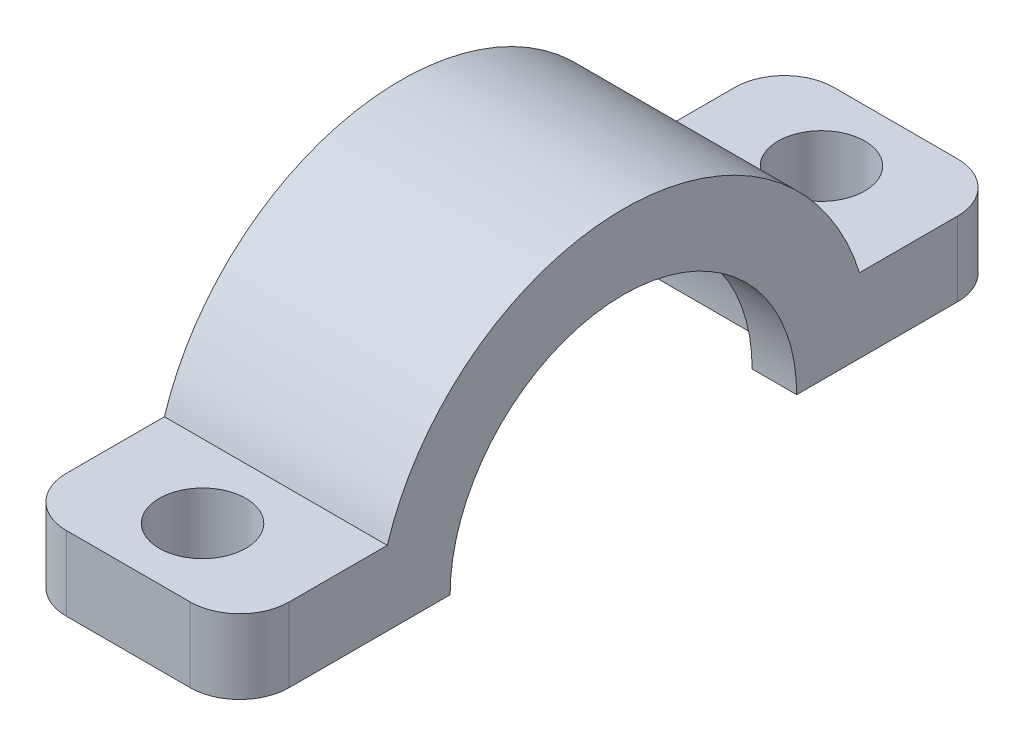
ISO-10303-21;
HEADER;
FILE_DESCRIPTION(('STEP AP214'),'2;1');
FILE_NAME('part.step','',(''),(''),'','','');
FILE_SCHEMA(('AUTOMOTIVE_DESIGN { 1 0 10303 214 1 1 1 1 }'));
ENDSEC;
DATA;
#1=APPLICATION_CONTEXT('core data for automotive mechanical design processes');
#2=APPLICATION_PROTOCOL_DEFINITION('international standard','automotive_design',2000,#1);
#3=PRODUCT_CONTEXT('',#1,'mechanical');
#4=PRODUCT('Part','Part','',(#3));
#5=PRODUCT_RELATED_PRODUCT_CATEGORY('part','',(#4));
#6=PRODUCT_DEFINITION_FORMATION('','',#4);
#7=PRODUCT_DEFINITION_CONTEXT('part definition',#1,'design');
#8=PRODUCT_DEFINITION('design','',#6,#7);
#9=PRODUCT_DEFINITION_SHAPE('','',#8);
#10=(LENGTH_UNIT() NAMED_UNIT(*) SI_UNIT(.MILLI.,.METRE.));
#11=(NAMED_UNIT(*) PLANE_ANGLE_UNIT() SI_UNIT($,.RADIAN.));
#12=(NAMED_UNIT(*) SI_UNIT($,.STERADIAN.) SOLID_ANGLE_UNIT());
#13=UNCERTAINTY_MEASURE_WITH_UNIT(LENGTH_MEASURE(1.E-05),#10,'distance_accuracy_value','');
#14=(GEOMETRIC_REPRESENTATION_CONTEXT(3) GLOBAL_UNCERTAINTY_ASSIGNED_CONTEXT((#13)) GLOBAL_UNIT_ASSIGNED_CONTEXT((#10,
#11,#12)) REPRESENTATION_CONTEXT('',''));
#15=CARTESIAN_POINT('',(0.,0.,0.));
#16=DIRECTION('',(0.,0.,1.));
#17=DIRECTION('',(1.,0.,0.));
#18=AXIS2_PLACEMENT_3D('',#15,#16,#17);
#19=CARTESIAN_POINT('',(-4.5,-1.5,0.));
#20=DIRECTION('',(1.,0.,0.));
#21=DIRECTION('',(0.,0.,-1.));
#22=AXIS2_PLACEMENT_3D('',#19,#20,#21);
#23=CYLINDRICAL_SURFACE('',#22,7.);
#24=DIRECTION('',(1.,0.,0.));
#25=VECTOR('',#24,1.);
#26=CARTESIAN_POINT('',(-4.5,-1.5,-7.));
#27=LINE('',#26,#25);
#28=CARTESIAN_POINT('',(-4.5,-1.5,-7.));
#29=VERTEX_POINT('',#28);
#30=CARTESIAN_POINT('',(-2.7,-1.5,-7.));
#31=VERTEX_POINT('',#30);
#32=EDGE_CURVE('E249',#29,#31,#27,.T.);
#33=ORIENTED_EDGE('',*,*,#32,.T.);
#34=CARTESIAN_POINT('',(-2.7,-1.5,0.));
#35=DIRECTION('',(1.,0.,0.));
#36=DIRECTION('',(0.,0.,-1.));
#37=AXIS2_PLACEMENT_3D('',#34,#35,#36);
#38=CIRCLE('',#37,7.);
#39=CARTESIAN_POINT('',(-2.7,-1.5,7.));
#40=VERTEX_POINT('',#39);
#41=EDGE_CURVE('E159',#31,#40,#38,.T.);
#42=ORIENTED_EDGE('',*,*,#41,.T.);
#43=DIRECTION('',(1.,0.,0.));
#44=VECTOR('',#43,1.);
#45=CARTESIAN_POINT('',(-4.5,-1.5,7.));
#46=LINE('',#45,#44);
#47=CARTESIAN_POINT('',(-4.5,-1.5,7.));
#48=VERTEX_POINT('',#47);
#49=EDGE_CURVE('E254',#48,#40,#46,.T.);
#50=ORIENTED_EDGE('',*,*,#49,.F.);
#51=CARTESIAN_POINT('',(-4.5,-1.5,0.));
#52=DIRECTION('',(-1.,0.,0.));
#53=DIRECTION('',(0.,0.,-1.));
#54=AXIS2_PLACEMENT_3D('',#51,#52,#53);
#55=CIRCLE('',#54,7.);
#56=EDGE_CURVE('E244',#48,#29,#55,.T.);
#57=ORIENTED_EDGE('',*,*,#56,.T.);
#58=EDGE_LOOP('',(#33,#42,#50,#57));
#59=FACE_BOUND('',#58,.T.);
#60=ADVANCED_FACE('F43',(#59),#23,.F.);
#61=CARTESIAN_POINT('',(-4.5,-1.5,-7.));
#62=DIRECTION('',(0.,-1.,0.));
#63=DIRECTION('',(0.,0.,-1.));
#64=AXIS2_PLACEMENT_3D('',#61,#62,#63);
#65=PLANE('',#64);
#66=DIRECTION('',(0.,0.,1.));
#67=VECTOR('',#66,1.);
#68=CARTESIAN_POINT('',(2.7,-1.5,-7.));
#69=LINE('',#68,#67);
#70=CARTESIAN_POINT('',(2.7,-1.5,-8.25));
#71=VERTEX_POINT('',#70);
#72=CARTESIAN_POINT('',(2.7,-1.5,-7.));
#73=VERTEX_POINT('',#72);
#74=EDGE_CURVE('E180',#71,#73,#69,.T.);
#75=ORIENTED_EDGE('',*,*,#74,.F.);
#76=DIRECTION('',(-1.,0.,0.));
#77=VECTOR('',#76,1.);
#78=CARTESIAN_POINT('',(2.7,-1.5,-8.25));
#79=LINE('',#78,#77);
#80=CARTESIAN_POINT('',(-2.7,-1.5,-8.25));
#81=VERTEX_POINT('',#80);
#82=EDGE_CURVE('E169',#71,#81,#79,.T.);
#83=ORIENTED_EDGE('',*,*,#82,.T.);
#84=DIRECTION('',(0.,0.,1.));
#85=VECTOR('',#84,1.);
#86=CARTESIAN_POINT('',(-2.7,-1.5,-7.));
#87=LINE('',#86,#85);
#88=EDGE_CURVE('E156',#81,#31,#87,.T.);
#89=ORIENTED_EDGE('',*,*,#88,.T.);
#90=ORIENTED_EDGE('',*,*,#32,.F.);
#91=DIRECTION('',(0.,0.,-1.));
#92=VECTOR('',#91,1.);
#93=CARTESIAN_POINT('',(-4.5,-1.5,-7.));
#94=LINE('',#93,#92);
#95=CARTESIAN_POINT('',(-4.5,-1.5,-13.5));
#96=VERTEX_POINT('',#95);
#97=EDGE_CURVE('E226',#29,#96,#94,.T.);
#98=ORIENTED_EDGE('',*,*,#97,.T.);
#99=CARTESIAN_POINT('',(-2.5,-1.5,-13.5));
#100=DIRECTION('',(0.,-1.,0.));
#101=DIRECTION('',(0.,0.,-1.));
#102=AXIS2_PLACEMENT_3D('',#99,#100,#101);
#103=CIRCLE('',#102,2.);
#104=CARTESIAN_POINT('',(-2.5,-1.5,-15.5));
#105=VERTEX_POINT('',#104);
#106=EDGE_CURVE('E323',#96,#105,#103,.T.);
#107=ORIENTED_EDGE('',*,*,#106,.T.);
#108=DIRECTION('',(1.,0.,0.));
#109=VECTOR('',#108,1.);
#110=CARTESIAN_POINT('',(-4.5,-1.5,-15.5));
#111=LINE('',#110,#109);
#112=CARTESIAN_POINT('',(2.5,-1.5,-15.5));
#113=VERTEX_POINT('',#112);
#114=EDGE_CURVE('E248',#105,#113,#111,.T.);
#115=ORIENTED_EDGE('',*,*,#114,.T.);
#116=CARTESIAN_POINT('',(2.5,-1.5,-13.5));
#117=DIRECTION('',(0.,-1.,0.));
#118=DIRECTION('',(0.,0.,-1.));
#119=AXIS2_PLACEMENT_3D('',#116,#117,#118);
#120=CIRCLE('',#119,2.);
#121=CARTESIAN_POINT('',(4.5,-1.5,-13.5));
#122=VERTEX_POINT('',#121);
#123=EDGE_CURVE('E326',#113,#122,#120,.T.);
#124=ORIENTED_EDGE('',*,*,#123,.T.);
#125=DIRECTION('',(0.,0.,-1.));
#126=VECTOR('',#125,1.);
#127=CARTESIAN_POINT('',(4.5,-1.5,-7.));
#128=LINE('',#127,#126);
#129=CARTESIAN_POINT('',(4.5,-1.5,-7.));
#130=VERTEX_POINT('',#129);
#131=EDGE_CURVE('E196',#130,#122,#128,.T.);
#132=ORIENTED_EDGE('',*,*,#131,.F.);
#133=EDGE_CURVE('E253',#73,#130,#27,.T.);
#134=ORIENTED_EDGE('',*,*,#133,.F.);
#135=EDGE_LOOP('',(#75,#83,#89,#90,#98,#107,#115,#124,#132,#134));
#136=FACE_BOUND('',#135,.T.);
#137=CARTESIAN_POINT('',(0.,-1.5,-12.5));
#138=DIRECTION('',(0.,1.,0.));
#139=DIRECTION('',(0.,0.,1.));
#140=AXIS2_PLACEMENT_3D('',#137,#138,#139);
#141=CIRCLE('',#140,1.75);
#142=CARTESIAN_POINT('',(0.,-1.5,-10.75));
#143=VERTEX_POINT('',#142);
#144=EDGE_CURVE('E192',#143,#143,#141,.T.);
#145=ORIENTED_EDGE('',*,*,#144,.T.);
#146=EDGE_LOOP('',(#145));
#147=FACE_BOUND('',#146,.T.);
#148=ADVANCED_FACE('F177',(#136,#147),#65,.T.);
#149=CARTESIAN_POINT('',(2.7,-1.5,0.));
#150=DIRECTION('',(1.,0.,0.));
#151=DIRECTION('',(0.,0.,-1.));
#152=AXIS2_PLACEMENT_3D('',#149,#150,#151);
#153=CIRCLE('',#152,7.);
#154=CARTESIAN_POINT('',(2.7,-1.5,7.));
#155=VERTEX_POINT('',#154);
#156=EDGE_CURVE('E164',#73,#155,#153,.T.);
#157=ORIENTED_EDGE('',*,*,#156,.F.);
#158=ORIENTED_EDGE('',*,*,#133,.T.);
#159=CARTESIAN_POINT('',(4.5,-1.5,0.));
#160=DIRECTION('',(-1.,0.,0.));
#161=DIRECTION('',(0.,0.,-1.));
#162=AXIS2_PLACEMENT_3D('',#159,#160,#161);
#163=CIRCLE('',#162,7.);
#164=CARTESIAN_POINT('',(4.5,-1.5,7.));
#165=VERTEX_POINT('',#164);
#166=EDGE_CURVE('E222',#165,#130,#163,.T.);
#167=ORIENTED_EDGE('',*,*,#166,.F.);
#168=EDGE_CURVE('E258',#155,#165,#46,.T.);
#169=ORIENTED_EDGE('',*,*,#168,.F.);
#170=EDGE_LOOP('',(#157,#158,#167,#169));
#171=FACE_BOUND('',#170,.T.);
#172=ADVANCED_FACE('F349',(#171),#23,.F.);
#173=CARTESIAN_POINT('',(-4.5,-1.5,15.5));
#174=DIRECTION('',(0.,-1.,0.));
#175=DIRECTION('',(0.,0.,-1.));
#176=AXIS2_PLACEMENT_3D('',#173,#174,#175);
#177=PLANE('',#176);
#178=DIRECTION('',(0.,0.,1.));
#179=VECTOR('',#178,1.);
#180=CARTESIAN_POINT('',(2.7,-1.5,15.5));
#181=LINE('',#180,#179);
#182=CARTESIAN_POINT('',(2.7,-1.5,8.25));
#183=VERTEX_POINT('',#182);
#184=EDGE_CURVE('E11',#155,#183,#181,.T.);
#185=ORIENTED_EDGE('',*,*,#184,.F.);
#186=ORIENTED_EDGE('',*,*,#168,.T.);
#187=DIRECTION('',(0.,0.,-1.));
#188=VECTOR('',#187,1.);
#189=CARTESIAN_POINT('',(4.5,-1.5,15.5));
#190=LINE('',#189,#188);
#191=CARTESIAN_POINT('',(4.5,-1.5,13.5));
#192=VERTEX_POINT('',#191);
#193=EDGE_CURVE('E218',#192,#165,#190,.T.);
#194=ORIENTED_EDGE('',*,*,#193,.F.);
#195=CARTESIAN_POINT('',(2.5,-1.5,13.5));
#196=DIRECTION('',(0.,-1.,0.));
#197=DIRECTION('',(0.,0.,-1.));
#198=AXIS2_PLACEMENT_3D('',#195,#196,#197);
#199=CIRCLE('',#198,2.);
#200=CARTESIAN_POINT('',(2.5,-1.5,15.5));
#201=VERTEX_POINT('',#200);
#202=EDGE_CURVE('E289',#192,#201,#199,.T.);
#203=ORIENTED_EDGE('',*,*,#202,.T.);
#204=DIRECTION('',(1.,0.,0.));
#205=VECTOR('',#204,1.);
#206=CARTESIAN_POINT('',(-4.5,-1.5,15.5));
#207=LINE('',#206,#205);
#208=CARTESIAN_POINT('',(-2.5,-1.5,15.5));
#209=VERTEX_POINT('',#208);
#210=EDGE_CURVE('E259',#209,#201,#207,.T.);
#211=ORIENTED_EDGE('',*,*,#210,.F.);
#212=CARTESIAN_POINT('',(-2.5,-1.5,13.5));
#213=DIRECTION('',(0.,-1.,0.));
#214=DIRECTION('',(0.,0.,-1.));
#215=AXIS2_PLACEMENT_3D('',#212,#213,#214);
#216=CIRCLE('',#215,2.);
#217=CARTESIAN_POINT('',(-4.5,-1.5,13.5));
#218=VERTEX_POINT('',#217);
#219=EDGE_CURVE('E286',#209,#218,#216,.T.);
#220=ORIENTED_EDGE('',*,*,#219,.T.);
#221=DIRECTION('',(0.,0.,-1.));
#222=VECTOR('',#221,1.);
#223=CARTESIAN_POINT('',(-4.5,-1.5,15.5));
#224=LINE('',#223,#222);
#225=EDGE_CURVE('E241',#218,#48,#224,.T.);
#226=ORIENTED_EDGE('',*,*,#225,.T.);
#227=ORIENTED_EDGE('',*,*,#49,.T.);
#228=DIRECTION('',(0.,0.,1.));
#229=VECTOR('',#228,1.);
#230=CARTESIAN_POINT('',(-2.7,-1.5,15.5));
#231=LINE('',#230,#229);
#232=CARTESIAN_POINT('',(-2.7,-1.5,8.25));
#233=VERTEX_POINT('',#232);
#234=EDGE_CURVE('E329',#40,#233,#231,.T.);
#235=ORIENTED_EDGE('',*,*,#234,.T.);
#236=DIRECTION('',(-1.,0.,0.));
#237=VECTOR('',#236,1.);
#238=CARTESIAN_POINT('',(2.7,-1.5,8.25));
#239=LINE('',#238,#237);
#240=EDGE_CURVE('E52',#233,#183,#239,.F.);
#241=ORIENTED_EDGE('',*,*,#240,.T.);
#242=EDGE_LOOP('',(#185,#186,#194,#203,#211,#220,#226,#227,#235,#241));
#243=FACE_BOUND('',#242,.T.);
#244=CARTESIAN_POINT('',(0.,-1.5,12.5));
#245=DIRECTION('',(0.,1.,0.));
#246=DIRECTION('',(0.,0.,1.));
#247=AXIS2_PLACEMENT_3D('',#244,#245,#246);
#248=CIRCLE('',#247,1.75);
#249=CARTESIAN_POINT('',(0.,-1.5,14.25));
#250=VERTEX_POINT('',#249);
#251=EDGE_CURVE('E182',#250,#250,#248,.T.);
#252=ORIENTED_EDGE('',*,*,#251,.T.);
#253=EDGE_LOOP('',(#252));
#254=FACE_BOUND('',#253,.T.);
#255=ADVANCED_FACE('F334',(#243,#254),#177,.T.);
#256=CARTESIAN_POINT('',(-4.5,1.5,15.5));
#257=DIRECTION('',(0.,0.,1.));
#258=DIRECTION('',(1.,0.,0.));
#259=AXIS2_PLACEMENT_3D('',#256,#257,#258);
#260=PLANE('',#259);
#261=ORIENTED_EDGE('',*,*,#210,.T.);
#262=DIRECTION('',(0.,-1.,0.));
#263=VECTOR('',#262,1.);
#264=CARTESIAN_POINT('',(2.5,1.5,15.5));
#265=LINE('',#264,#263);
#266=CARTESIAN_POINT('',(2.5,1.5,15.5));
#267=VERTEX_POINT('',#266);
#268=EDGE_CURVE('E296',#201,#267,#265,.F.);
#269=ORIENTED_EDGE('',*,*,#268,.T.);
#270=DIRECTION('',(1.,0.,0.));
#271=VECTOR('',#270,1.);
#272=CARTESIAN_POINT('',(-4.5,1.5,15.5));
#273=LINE('',#272,#271);
#274=CARTESIAN_POINT('',(-2.5,1.5,15.5));
#275=VERTEX_POINT('',#274);
#276=EDGE_CURVE('E263',#275,#267,#273,.T.);
#277=ORIENTED_EDGE('',*,*,#276,.F.);
#278=DIRECTION('',(0.,-1.,0.));
#279=VECTOR('',#278,1.);
#280=CARTESIAN_POINT('',(-2.5,-1.5,15.5));
#281=LINE('',#280,#279);
#282=EDGE_CURVE('E292',#275,#209,#281,.T.);
#283=ORIENTED_EDGE('',*,*,#282,.T.);
#284=EDGE_LOOP('',(#261,#269,#277,#283));
#285=FACE_BOUND('',#284,.T.);
#286=ADVANCED_FACE('F365',(#285),#260,.T.);
#287=CARTESIAN_POINT('',(-4.5,1.5,15.5));
#288=DIRECTION('',(0.,1.,0.));
#289=DIRECTION('',(0.,0.,1.));
#290=AXIS2_PLACEMENT_3D('',#287,#288,#289);
#291=PLANE('',#290);
#292=CARTESIAN_POINT('',(0.,1.5,12.5));
#293=DIRECTION('',(0.,1.,0.));
#294=DIRECTION('',(0.,0.,1.));
#295=AXIS2_PLACEMENT_3D('',#292,#293,#294);
#296=CIRCLE('',#295,1.75);
#297=CARTESIAN_POINT('',(0.,1.5,14.25));
#298=VERTEX_POINT('',#297);
#299=EDGE_CURVE('E187',#298,#298,#296,.T.);
#300=ORIENTED_EDGE('',*,*,#299,.F.);
#301=EDGE_LOOP('',(#300));
#302=FACE_BOUND('',#301,.T.);
#303=ORIENTED_EDGE('',*,*,#276,.T.);
#304=CARTESIAN_POINT('',(2.5,1.5,13.5));
#305=DIRECTION('',(0.,1.,0.));
#306=DIRECTION('',(0.,0.,1.));
#307=AXIS2_PLACEMENT_3D('',#304,#305,#306);
#308=CIRCLE('',#307,2.);
#309=CARTESIAN_POINT('',(4.5,1.5,13.5));
#310=VERTEX_POINT('',#309);
#311=EDGE_CURVE('E302',#267,#310,#308,.T.);
#312=ORIENTED_EDGE('',*,*,#311,.T.);
#313=DIRECTION('',(0.,0.,1.));
#314=VECTOR('',#313,1.);
#315=CARTESIAN_POINT('',(4.5,1.5,15.5));
#316=LINE('',#315,#314);
#317=CARTESIAN_POINT('',(4.5,1.5,9.53939201416946));
#318=VERTEX_POINT('',#317);
#319=EDGE_CURVE('E214',#318,#310,#316,.T.);
#320=ORIENTED_EDGE('',*,*,#319,.F.);
#321=DIRECTION('',(1.,0.,0.));
#322=VECTOR('',#321,1.);
#323=CARTESIAN_POINT('',(-4.5,1.5,9.53939201416946));
#324=LINE('',#323,#322);
#325=CARTESIAN_POINT('',(-4.5,1.5,9.53939201416946));
#326=VERTEX_POINT('',#325);
#327=EDGE_CURVE('E267',#326,#318,#324,.T.);
#328=ORIENTED_EDGE('',*,*,#327,.F.);
#329=DIRECTION('',(0.,0.,1.));
#330=VECTOR('',#329,1.);
#331=CARTESIAN_POINT('',(-4.5,1.5,15.5));
#332=LINE('',#331,#330);
#333=CARTESIAN_POINT('',(-4.5,1.5,13.5));
#334=VERTEX_POINT('',#333);
#335=EDGE_CURVE('E237',#326,#334,#332,.T.);
#336=ORIENTED_EDGE('',*,*,#335,.T.);
#337=CARTESIAN_POINT('',(-2.5,1.5,13.5));
#338=DIRECTION('',(0.,1.,0.));
#339=DIRECTION('',(0.,0.,1.));
#340=AXIS2_PLACEMENT_3D('',#337,#338,#339);
#341=CIRCLE('',#340,2.);
#342=EDGE_CURVE('E299',#334,#275,#341,.T.);
#343=ORIENTED_EDGE('',*,*,#342,.T.);
#344=EDGE_LOOP('',(#303,#312,#320,#328,#336,#343));
#345=FACE_BOUND('',#344,.T.);
#346=ADVANCED_FACE('F397',(#302,#345),#291,.T.);
#347=CARTESIAN_POINT('',(-4.5,-1.5,0.));
#348=DIRECTION('',(1.,0.,0.));
#349=DIRECTION('',(0.,0.,-1.));
#350=AXIS2_PLACEMENT_3D('',#347,#348,#349);
#351=CYLINDRICAL_SURFACE('',#350,10.);
#352=ORIENTED_EDGE('',*,*,#327,.T.);
#353=CARTESIAN_POINT('',(4.5,-1.5,0.));
#354=DIRECTION('',(1.,0.,0.));
#355=DIRECTION('',(0.,0.,-1.));
#356=AXIS2_PLACEMENT_3D('',#353,#354,#355);
#357=CIRCLE('',#356,10.);
#358=CARTESIAN_POINT('',(4.5,1.5,-9.53939201416946));
#359=VERTEX_POINT('',#358);
#360=EDGE_CURVE('E210',#359,#318,#357,.T.);
#361=ORIENTED_EDGE('',*,*,#360,.F.);
#362=DIRECTION('',(1.,0.,0.));
#363=VECTOR('',#362,1.);
#364=CARTESIAN_POINT('',(-4.5,1.5,-9.53939201416946));
#365=LINE('',#364,#363);
#366=CARTESIAN_POINT('',(-4.5,1.5,-9.53939201416946));
#367=VERTEX_POINT('',#366);
#368=EDGE_CURVE('E270',#367,#359,#365,.T.);
#369=ORIENTED_EDGE('',*,*,#368,.F.);
#370=CARTESIAN_POINT('',(-4.5,-1.5,0.));
#371=DIRECTION('',(1.,0.,0.));
#372=DIRECTION('',(0.,0.,-1.));
#373=AXIS2_PLACEMENT_3D('',#370,#371,#372);
#374=CIRCLE('',#373,10.);
#375=EDGE_CURVE('E233',#367,#326,#374,.T.);
#376=ORIENTED_EDGE('',*,*,#375,.T.);
#377=EDGE_LOOP('',(#352,#361,#369,#376));
#378=FACE_BOUND('',#377,.T.);
#379=ADVANCED_FACE('F395',(#378),#351,.T.);
#380=CARTESIAN_POINT('',(-4.5,1.5,-9.53939201416946));
#381=DIRECTION('',(0.,1.,0.));
#382=DIRECTION('',(0.,0.,1.));
#383=AXIS2_PLACEMENT_3D('',#380,#381,#382);
#384=PLANE('',#383);
#385=CARTESIAN_POINT('',(0.,1.5,-12.5));
#386=DIRECTION('',(0.,1.,0.));
#387=DIRECTION('',(0.,0.,1.));
#388=AXIS2_PLACEMENT_3D('',#385,#386,#387);
#389=CIRCLE('',#388,1.75);
#390=CARTESIAN_POINT('',(0.,1.5,-10.75));
#391=VERTEX_POINT('',#390);
#392=EDGE_CURVE('E197',#391,#391,#389,.T.);
#393=ORIENTED_EDGE('',*,*,#392,.F.);
#394=EDGE_LOOP('',(#393));
#395=FACE_BOUND('',#394,.T.);
#396=DIRECTION('',(0.,0.,1.));
#397=VECTOR('',#396,1.);
#398=CARTESIAN_POINT('',(4.5,1.5,-9.53939201416946));
#399=LINE('',#398,#397);
#400=CARTESIAN_POINT('',(4.5,1.5,-13.5));
#401=VERTEX_POINT('',#400);
#402=EDGE_CURVE('E207',#401,#359,#399,.T.);
#403=ORIENTED_EDGE('',*,*,#402,.F.);
#404=CARTESIAN_POINT('',(2.5,1.5,-13.5));
#405=DIRECTION('',(0.,1.,0.));
#406=DIRECTION('',(0.,0.,1.));
#407=AXIS2_PLACEMENT_3D('',#404,#405,#406);
#408=CIRCLE('',#407,2.);
#409=CARTESIAN_POINT('',(2.5,1.5,-15.5));
#410=VERTEX_POINT('',#409);
#411=EDGE_CURVE('E314',#401,#410,#408,.T.);
#412=ORIENTED_EDGE('',*,*,#411,.T.);
#413=DIRECTION('',(1.,0.,0.));
#414=VECTOR('',#413,1.);
#415=CARTESIAN_POINT('',(-4.5,1.5,-15.5));
#416=LINE('',#415,#414);
#417=CARTESIAN_POINT('',(-2.5,1.5,-15.5));
#418=VERTEX_POINT('',#417);
#419=EDGE_CURVE('E274',#418,#410,#416,.T.);
#420=ORIENTED_EDGE('',*,*,#419,.F.);
#421=CARTESIAN_POINT('',(-2.5,1.5,-13.5));
#422=DIRECTION('',(0.,1.,0.));
#423=DIRECTION('',(0.,0.,1.));
#424=AXIS2_PLACEMENT_3D('',#421,#422,#423);
#425=CIRCLE('',#424,2.);
#426=CARTESIAN_POINT('',(-4.5,1.5,-13.5));
#427=VERTEX_POINT('',#426);
#428=EDGE_CURVE('E311',#418,#427,#425,.T.);
#429=ORIENTED_EDGE('',*,*,#428,.T.);
#430=DIRECTION('',(0.,0.,1.));
#431=VECTOR('',#430,1.);
#432=CARTESIAN_POINT('',(-4.5,1.5,-9.53939201416946));
#433=LINE('',#432,#431);
#434=EDGE_CURVE('E230',#427,#367,#433,.T.);
#435=ORIENTED_EDGE('',*,*,#434,.T.);
#436=ORIENTED_EDGE('',*,*,#368,.T.);
#437=EDGE_LOOP('',(#403,#412,#420,#429,#435,#436));
#438=FACE_BOUND('',#437,.T.);
#439=ADVANCED_FACE('F386',(#395,#438),#384,.T.);
#440=CARTESIAN_POINT('',(-4.5,1.5,-15.5));
#441=DIRECTION('',(0.,0.,-1.));
#442=DIRECTION('',(-1.,0.,0.));
#443=AXIS2_PLACEMENT_3D('',#440,#441,#442);
#444=PLANE('',#443);
#445=ORIENTED_EDGE('',*,*,#419,.T.);
#446=DIRECTION('',(0.,1.,0.));
#447=VECTOR('',#446,1.);
#448=CARTESIAN_POINT('',(2.5,1.5,-15.5));
#449=LINE('',#448,#447);
#450=EDGE_CURVE('E67',#410,#113,#449,.F.);
#451=ORIENTED_EDGE('',*,*,#450,.T.);
#452=ORIENTED_EDGE('',*,*,#114,.F.);
#453=DIRECTION('',(0.,1.,0.));
#454=VECTOR('',#453,1.);
#455=CARTESIAN_POINT('',(-2.5,1.5,-15.5));
#456=LINE('',#455,#454);
#457=EDGE_CURVE('E317',#105,#418,#456,.T.);
#458=ORIENTED_EDGE('',*,*,#457,.T.);
#459=EDGE_LOOP('',(#445,#451,#452,#458));
#460=FACE_BOUND('',#459,.T.);
#461=ADVANCED_FACE('F383',(#460),#444,.T.);
#462=CARTESIAN_POINT('',(-4.5,-1.5,0.));
#463=DIRECTION('',(1.,0.,0.));
#464=DIRECTION('',(0.,0.,-1.));
#465=AXIS2_PLACEMENT_3D('',#462,#463,#464);
#466=PLANE('',#465);
#467=ORIENTED_EDGE('',*,*,#225,.F.);
#468=DIRECTION('',(0.,-1.,0.));
#469=VECTOR('',#468,1.);
#470=CARTESIAN_POINT('',(-4.5,1.5,13.5));
#471=LINE('',#470,#469);
#472=EDGE_CURVE('E308',#218,#334,#471,.F.);
#473=ORIENTED_EDGE('',*,*,#472,.T.);
#474=ORIENTED_EDGE('',*,*,#335,.F.);
#475=ORIENTED_EDGE('',*,*,#375,.F.);
#476=ORIENTED_EDGE('',*,*,#434,.F.);
#477=DIRECTION('',(0.,1.,0.));
#478=VECTOR('',#477,1.);
#479=CARTESIAN_POINT('',(-4.5,-1.5,-13.5));
#480=LINE('',#479,#478);
#481=EDGE_CURVE('E305',#427,#96,#480,.F.);
#482=ORIENTED_EDGE('',*,*,#481,.T.);
#483=ORIENTED_EDGE('',*,*,#97,.F.);
#484=ORIENTED_EDGE('',*,*,#56,.F.);
#485=EDGE_LOOP('',(#467,#473,#474,#475,#476,#482,#483,#484));
#486=FACE_BOUND('',#485,.T.);
#487=ADVANCED_FACE('F374',(#486),#466,.F.);
#488=CARTESIAN_POINT('',(4.5,-1.5,0.));
#489=DIRECTION('',(1.,0.,0.));
#490=DIRECTION('',(0.,0.,-1.));
#491=AXIS2_PLACEMENT_3D('',#488,#489,#490);
#492=PLANE('',#491);
#493=ORIENTED_EDGE('',*,*,#319,.T.);
#494=DIRECTION('',(0.,-1.,0.));
#495=VECTOR('',#494,1.);
#496=CARTESIAN_POINT('',(4.5,-1.5,13.5));
#497=LINE('',#496,#495);
#498=EDGE_CURVE('E282',#310,#192,#497,.T.);
#499=ORIENTED_EDGE('',*,*,#498,.T.);
#500=ORIENTED_EDGE('',*,*,#193,.T.);
#501=ORIENTED_EDGE('',*,*,#166,.T.);
#502=ORIENTED_EDGE('',*,*,#131,.T.);
#503=DIRECTION('',(0.,1.,0.));
#504=VECTOR('',#503,1.);
#505=CARTESIAN_POINT('',(4.5,-1.5,-13.5));
#506=LINE('',#505,#504);
#507=EDGE_CURVE('E252',#122,#401,#506,.T.);
#508=ORIENTED_EDGE('',*,*,#507,.T.);
#509=ORIENTED_EDGE('',*,*,#402,.T.);
#510=ORIENTED_EDGE('',*,*,#360,.T.);
#511=EDGE_LOOP('',(#493,#499,#500,#501,#502,#508,#509,#510));
#512=FACE_BOUND('',#511,.T.);
#513=ADVANCED_FACE('F356',(#512),#492,.T.);
#514=CARTESIAN_POINT('',(0.,-1.5,-12.5));
#515=DIRECTION('',(0.,1.,0.));
#516=DIRECTION('',(0.,0.,1.));
#517=AXIS2_PLACEMENT_3D('',#514,#515,#516);
#518=CYLINDRICAL_SURFACE('',#517,1.75);
#519=ORIENTED_EDGE('',*,*,#144,.F.);
#520=EDGE_LOOP('',(#519));
#521=FACE_BOUND('',#520,.T.);
#522=ORIENTED_EDGE('',*,*,#392,.T.);
#523=EDGE_LOOP('',(#522));
#524=FACE_BOUND('',#523,.T.);
#525=ADVANCED_FACE('F476',(#521,#524),#518,.F.);
#526=CARTESIAN_POINT('',(0.,-1.5,12.5));
#527=DIRECTION('',(0.,1.,0.));
#528=DIRECTION('',(0.,0.,1.));
#529=AXIS2_PLACEMENT_3D('',#526,#527,#528);
#530=CYLINDRICAL_SURFACE('',#529,1.75);
#531=ORIENTED_EDGE('',*,*,#251,.F.);
#532=EDGE_LOOP('',(#531));
#533=FACE_BOUND('',#532,.T.);
#534=ORIENTED_EDGE('',*,*,#299,.T.);
#535=EDGE_LOOP('',(#534));
#536=FACE_BOUND('',#535,.T.);
#537=ADVANCED_FACE('F434',(#533,#536),#530,.F.);
#538=CARTESIAN_POINT('',(2.5,-1.5,13.5));
#539=DIRECTION('',(0.,-1.,0.));
#540=DIRECTION('',(0.,0.,-1.));
#541=AXIS2_PLACEMENT_3D('',#538,#539,#540);
#542=CYLINDRICAL_SURFACE('',#541,2.);
#543=ORIENTED_EDGE('',*,*,#311,.F.);
#544=ORIENTED_EDGE('',*,*,#268,.F.);
#545=ORIENTED_EDGE('',*,*,#202,.F.);
#546=ORIENTED_EDGE('',*,*,#498,.F.);
#547=EDGE_LOOP('',(#543,#544,#545,#546));
#548=FACE_BOUND('',#547,.T.);
#549=ADVANCED_FACE('F361',(#548),#542,.T.);
#550=CARTESIAN_POINT('',(-2.5,1.5,13.5));
#551=DIRECTION('',(0.,1.,0.));
#552=DIRECTION('',(0.,0.,1.));
#553=AXIS2_PLACEMENT_3D('',#550,#551,#552);
#554=CYLINDRICAL_SURFACE('',#553,2.);
#555=ORIENTED_EDGE('',*,*,#342,.F.);
#556=ORIENTED_EDGE('',*,*,#472,.F.);
#557=ORIENTED_EDGE('',*,*,#219,.F.);
#558=ORIENTED_EDGE('',*,*,#282,.F.);
#559=EDGE_LOOP('',(#555,#556,#557,#558));
#560=FACE_BOUND('',#559,.T.);
#561=ADVANCED_FACE('F370',(#560),#554,.T.);
#562=CARTESIAN_POINT('',(2.5,-1.5,-13.5));
#563=DIRECTION('',(0.,1.,0.));
#564=DIRECTION('',(0.,0.,1.));
#565=AXIS2_PLACEMENT_3D('',#562,#563,#564);
#566=CYLINDRICAL_SURFACE('',#565,2.);
#567=ORIENTED_EDGE('',*,*,#123,.F.);
#568=ORIENTED_EDGE('',*,*,#450,.F.);
#569=ORIENTED_EDGE('',*,*,#411,.F.);
#570=ORIENTED_EDGE('',*,*,#507,.F.);
#571=EDGE_LOOP('',(#567,#568,#569,#570));
#572=FACE_BOUND('',#571,.T.);
#573=ADVANCED_FACE('F390',(#572),#566,.T.);
#574=CARTESIAN_POINT('',(-2.5,1.5,-13.5));
#575=DIRECTION('',(0.,-1.,0.));
#576=DIRECTION('',(0.,0.,-1.));
#577=AXIS2_PLACEMENT_3D('',#574,#575,#576);
#578=CYLINDRICAL_SURFACE('',#577,2.);
#579=ORIENTED_EDGE('',*,*,#106,.F.);
#580=ORIENTED_EDGE('',*,*,#481,.F.);
#581=ORIENTED_EDGE('',*,*,#428,.F.);
#582=ORIENTED_EDGE('',*,*,#457,.F.);
#583=EDGE_LOOP('',(#579,#580,#581,#582));
#584=FACE_BOUND('',#583,.T.);
#585=ADVANCED_FACE('F45',(#584),#578,.T.);
#586=CARTESIAN_POINT('',(2.7,-1.5,0.));
#587=DIRECTION('',(-1.,0.,0.));
#588=DIRECTION('',(0.,0.,1.));
#589=AXIS2_PLACEMENT_3D('',#586,#587,#588);
#590=CYLINDRICAL_SURFACE('',#589,8.25);
#591=CARTESIAN_POINT('',(2.7,-1.5,0.));
#592=DIRECTION('',(1.,0.,0.));
#593=DIRECTION('',(0.,0.,-1.));
#594=AXIS2_PLACEMENT_3D('',#591,#592,#593);
#595=CIRCLE('',#594,8.25);
#596=EDGE_CURVE('E174',#71,#183,#595,.T.);
#597=ORIENTED_EDGE('',*,*,#596,.T.);
#598=ORIENTED_EDGE('',*,*,#240,.F.);
#599=CARTESIAN_POINT('',(-2.7,-1.5,0.));
#600=DIRECTION('',(1.,0.,0.));
#601=DIRECTION('',(0.,0.,-1.));
#602=AXIS2_PLACEMENT_3D('',#599,#600,#601);
#603=CIRCLE('',#602,8.25);
#604=EDGE_CURVE('E59',#81,#233,#603,.T.);
#605=ORIENTED_EDGE('',*,*,#604,.F.);
#606=ORIENTED_EDGE('',*,*,#82,.F.);
#607=EDGE_LOOP('',(#597,#598,#605,#606));
#608=FACE_BOUND('',#607,.T.);
#609=ADVANCED_FACE('F168',(#608),#590,.F.);
#610=CARTESIAN_POINT('',(2.7,-1.5,0.));
#611=DIRECTION('',(1.,0.,0.));
#612=DIRECTION('',(0.,0.,-1.));
#613=AXIS2_PLACEMENT_3D('',#610,#611,#612);
#614=PLANE('',#613);
#615=ORIENTED_EDGE('',*,*,#74,.T.);
#616=ORIENTED_EDGE('',*,*,#156,.T.);
#617=ORIENTED_EDGE('',*,*,#184,.T.);
#618=ORIENTED_EDGE('',*,*,#596,.F.);
#619=EDGE_LOOP('',(#615,#616,#617,#618));
#620=FACE_BOUND('',#619,.T.);
#621=ADVANCED_FACE('F347',(#620),#614,.F.);
#622=CARTESIAN_POINT('',(-2.7,-1.5,0.));
#623=DIRECTION('',(1.,0.,0.));
#624=DIRECTION('',(0.,0.,-1.));
#625=AXIS2_PLACEMENT_3D('',#622,#623,#624);
#626=PLANE('',#625);
#627=ORIENTED_EDGE('',*,*,#604,.T.);
#628=ORIENTED_EDGE('',*,*,#234,.F.);
#629=ORIENTED_EDGE('',*,*,#41,.F.);
#630=ORIENTED_EDGE('',*,*,#88,.F.);
#631=EDGE_LOOP('',(#627,#628,#629,#630));
#632=FACE_BOUND('',#631,.T.);
#633=ADVANCED_FACE('F157',(#632),#626,.T.);
#634=CLOSED_SHELL('',(#60,#148,#172,#255,#286,#346,#379,#439,#461,#487,#513,#525,#537,#549,#561,
#573,#585,#609,#621,#633));
#635=MANIFOLD_SOLID_BREP('B2',#634);
#636=ADVANCED_BREP_SHAPE_REPRESENTATION('',(#18,#635),#14);
#637=SHAPE_DEFINITION_REPRESENTATION(#9,#636);
ENDSEC;
END-ISO-10303-21;
